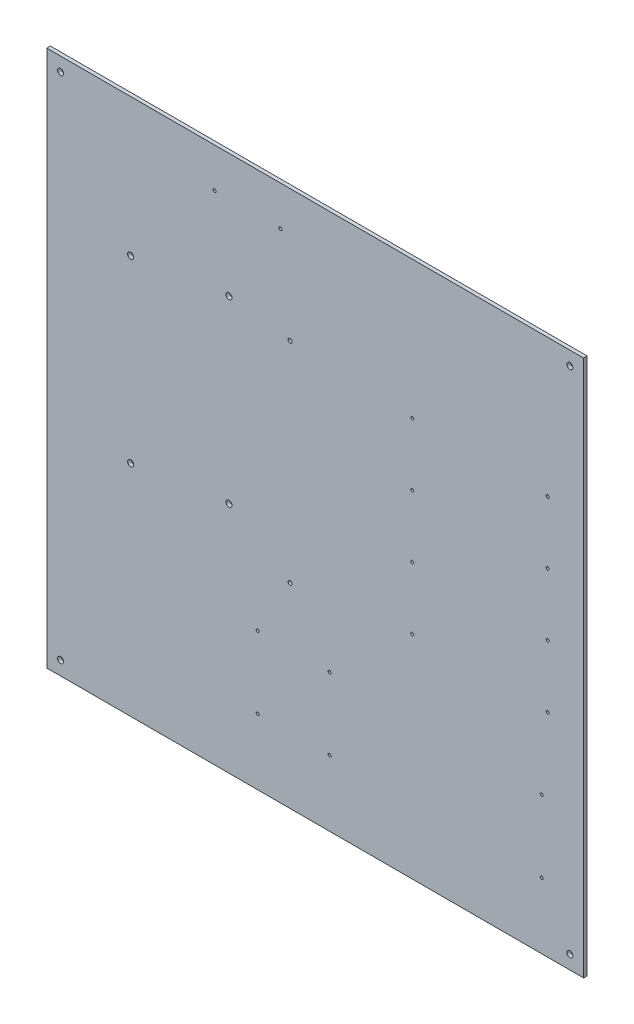
ISO-10303-21;
HEADER;
FILE_DESCRIPTION(('STEP AP214'),'2;1');
FILE_NAME('part.step','',(''),(''),'','','');
FILE_SCHEMA(('AUTOMOTIVE_DESIGN { 1 0 10303 214 1 1 1 1 }'));
ENDSEC;
DATA;
#1=APPLICATION_CONTEXT('core data for automotive mechanical design processes');
#2=APPLICATION_PROTOCOL_DEFINITION('international standard','automotive_design',2000,#1);
#3=PRODUCT_CONTEXT('',#1,'mechanical');
#4=PRODUCT('Part','Part','',(#3));
#5=PRODUCT_RELATED_PRODUCT_CATEGORY('part','',(#4));
#6=PRODUCT_DEFINITION_FORMATION('','',#4);
#7=PRODUCT_DEFINITION_CONTEXT('part definition',#1,'design');
#8=PRODUCT_DEFINITION('design','',#6,#7);
#9=PRODUCT_DEFINITION_SHAPE('','',#8);
#10=(LENGTH_UNIT() NAMED_UNIT(*) SI_UNIT(.MILLI.,.METRE.));
#11=(NAMED_UNIT(*) PLANE_ANGLE_UNIT() SI_UNIT($,.RADIAN.));
#12=(NAMED_UNIT(*) SI_UNIT($,.STERADIAN.) SOLID_ANGLE_UNIT());
#13=UNCERTAINTY_MEASURE_WITH_UNIT(LENGTH_MEASURE(1.E-05),#10,'distance_accuracy_value','');
#14=(GEOMETRIC_REPRESENTATION_CONTEXT(3) GLOBAL_UNCERTAINTY_ASSIGNED_CONTEXT((#13)) GLOBAL_UNIT_ASSIGNED_CONTEXT((#10,
#11,#12)) REPRESENTATION_CONTEXT('',''));
#15=CARTESIAN_POINT('',(0.,0.,0.));
#16=DIRECTION('',(0.,0.,1.));
#17=DIRECTION('',(1.,0.,0.));
#18=AXIS2_PLACEMENT_3D('',#15,#16,#17);
#19=CARTESIAN_POINT('',(0.,0.,-3.));
#20=DIRECTION('',(-1.,0.,0.));
#21=DIRECTION('',(0.,0.,1.));
#22=AXIS2_PLACEMENT_3D('',#19,#20,#21);
#23=PLANE('',#22);
#24=DIRECTION('',(0.,-1.,0.));
#25=VECTOR('',#24,1.);
#26=CARTESIAN_POINT('',(0.,0.,0.));
#27=LINE('',#26,#25);
#28=CARTESIAN_POINT('',(0.,448.,0.));
#29=VERTEX_POINT('',#28);
#30=CARTESIAN_POINT('',(0.,0.,0.));
#31=VERTEX_POINT('',#30);
#32=EDGE_CURVE('E108',#29,#31,#27,.T.);
#33=ORIENTED_EDGE('',*,*,#32,.F.);
#34=DIRECTION('',(0.,0.,1.));
#35=VECTOR('',#34,1.);
#36=CARTESIAN_POINT('',(0.,448.,-3.));
#37=LINE('',#36,#35);
#38=CARTESIAN_POINT('',(0.,448.,-3.));
#39=VERTEX_POINT('',#38);
#40=EDGE_CURVE('E12',#39,#29,#37,.T.);
#41=ORIENTED_EDGE('',*,*,#40,.F.);
#42=DIRECTION('',(0.,-1.,0.));
#43=VECTOR('',#42,1.);
#44=CARTESIAN_POINT('',(0.,0.,-3.));
#45=LINE('',#44,#43);
#46=CARTESIAN_POINT('',(0.,0.,-3.));
#47=VERTEX_POINT('',#46);
#48=EDGE_CURVE('E101',#39,#47,#45,.T.);
#49=ORIENTED_EDGE('',*,*,#48,.T.);
#50=DIRECTION('',(0.,0.,1.));
#51=VECTOR('',#50,1.);
#52=CARTESIAN_POINT('',(0.,0.,-3.));
#53=LINE('',#52,#51);
#54=EDGE_CURVE('E42',#47,#31,#53,.T.);
#55=ORIENTED_EDGE('',*,*,#54,.T.);
#56=EDGE_LOOP('',(#33,#41,#49,#55));
#57=FACE_BOUND('',#56,.T.);
#58=ADVANCED_FACE('F39',(#57),#23,.T.);
#59=CARTESIAN_POINT('',(0.,448.,-3.));
#60=DIRECTION('',(0.,1.,0.));
#61=DIRECTION('',(0.,0.,1.));
#62=AXIS2_PLACEMENT_3D('',#59,#60,#61);
#63=PLANE('',#62);
#64=DIRECTION('',(-1.,0.,0.));
#65=VECTOR('',#64,1.);
#66=CARTESIAN_POINT('',(0.,448.,0.));
#67=LINE('',#66,#65);
#68=CARTESIAN_POINT('',(448.,448.,0.));
#69=VERTEX_POINT('',#68);
#70=EDGE_CURVE('E103',#69,#29,#67,.T.);
#71=ORIENTED_EDGE('',*,*,#70,.F.);
#72=DIRECTION('',(0.,0.,1.));
#73=VECTOR('',#72,1.);
#74=CARTESIAN_POINT('',(448.,448.,-3.));
#75=LINE('',#74,#73);
#76=CARTESIAN_POINT('',(448.,448.,-3.));
#77=VERTEX_POINT('',#76);
#78=EDGE_CURVE('E48',#77,#69,#75,.T.);
#79=ORIENTED_EDGE('',*,*,#78,.F.);
#80=DIRECTION('',(-1.,0.,0.));
#81=VECTOR('',#80,1.);
#82=CARTESIAN_POINT('',(0.,448.,-3.));
#83=LINE('',#82,#81);
#84=EDGE_CURVE('E98',#77,#39,#83,.T.);
#85=ORIENTED_EDGE('',*,*,#84,.T.);
#86=ORIENTED_EDGE('',*,*,#40,.T.);
#87=EDGE_LOOP('',(#71,#79,#85,#86));
#88=FACE_BOUND('',#87,.T.);
#89=ADVANCED_FACE('F307',(#88),#63,.T.);
#90=CARTESIAN_POINT('',(448.,0.,-3.));
#91=DIRECTION('',(1.,0.,0.));
#92=DIRECTION('',(0.,0.,-1.));
#93=AXIS2_PLACEMENT_3D('',#90,#91,#92);
#94=PLANE('',#93);
#95=DIRECTION('',(0.,1.,0.));
#96=VECTOR('',#95,1.);
#97=CARTESIAN_POINT('',(448.,0.,0.));
#98=LINE('',#97,#96);
#99=CARTESIAN_POINT('',(448.,0.,0.));
#100=VERTEX_POINT('',#99);
#101=EDGE_CURVE('E93',#100,#69,#98,.T.);
#102=ORIENTED_EDGE('',*,*,#101,.F.);
#103=DIRECTION('',(0.,0.,1.));
#104=VECTOR('',#103,1.);
#105=CARTESIAN_POINT('',(448.,0.,-3.));
#106=LINE('',#105,#104);
#107=CARTESIAN_POINT('',(448.,0.,-3.));
#108=VERTEX_POINT('',#107);
#109=EDGE_CURVE('E88',#108,#100,#106,.T.);
#110=ORIENTED_EDGE('',*,*,#109,.F.);
#111=DIRECTION('',(0.,1.,0.));
#112=VECTOR('',#111,1.);
#113=CARTESIAN_POINT('',(448.,0.,-3.));
#114=LINE('',#113,#112);
#115=EDGE_CURVE('E91',#108,#77,#114,.T.);
#116=ORIENTED_EDGE('',*,*,#115,.T.);
#117=ORIENTED_EDGE('',*,*,#78,.T.);
#118=EDGE_LOOP('',(#102,#110,#116,#117));
#119=FACE_BOUND('',#118,.T.);
#120=ADVANCED_FACE('F90',(#119),#94,.T.);
#121=CARTESIAN_POINT('',(0.,0.,-3.));
#122=DIRECTION('',(0.,-1.,0.));
#123=DIRECTION('',(0.,0.,-1.));
#124=AXIS2_PLACEMENT_3D('',#121,#122,#123);
#125=PLANE('',#124);
#126=DIRECTION('',(1.,0.,0.));
#127=VECTOR('',#126,1.);
#128=CARTESIAN_POINT('',(0.,0.,0.));
#129=LINE('',#128,#127);
#130=EDGE_CURVE('E113',#31,#100,#129,.T.);
#131=ORIENTED_EDGE('',*,*,#130,.F.);
#132=ORIENTED_EDGE('',*,*,#54,.F.);
#133=DIRECTION('',(1.,0.,0.));
#134=VECTOR('',#133,1.);
#135=CARTESIAN_POINT('',(0.,0.,-3.));
#136=LINE('',#135,#134);
#137=EDGE_CURVE('E97',#47,#108,#136,.T.);
#138=ORIENTED_EDGE('',*,*,#137,.T.);
#139=ORIENTED_EDGE('',*,*,#109,.T.);
#140=EDGE_LOOP('',(#131,#132,#138,#139));
#141=FACE_BOUND('',#140,.T.);
#142=ADVANCED_FACE('F100',(#141),#125,.T.);
#143=CARTESIAN_POINT('',(0.,0.,-3.));
#144=DIRECTION('',(0.,0.,-1.));
#145=DIRECTION('',(-1.,0.,0.));
#146=AXIS2_PLACEMENT_3D('',#143,#144,#145);
#147=PLANE('',#146);
#148=CARTESIAN_POINT('',(413.,55.,-3.));
#149=DIRECTION('',(0.,0.,1.));
#150=DIRECTION('',(1.,0.,0.));
#151=AXIS2_PLACEMENT_3D('',#148,#149,#150);
#152=CIRCLE('',#151,1.24999999999996);
#153=CARTESIAN_POINT('',(414.25,55.,-3.));
#154=VERTEX_POINT('',#153);
#155=EDGE_CURVE('E145',#154,#154,#152,.T.);
#156=ORIENTED_EDGE('',*,*,#155,.T.);
#157=EDGE_LOOP('',(#156));
#158=FACE_BOUND('',#157,.T.);
#159=CARTESIAN_POINT('',(413.,115.,-3.));
#160=DIRECTION('',(0.,0.,1.));
#161=DIRECTION('',(1.,0.,0.));
#162=AXIS2_PLACEMENT_3D('',#159,#160,#161);
#163=CIRCLE('',#162,1.24999999999995);
#164=CARTESIAN_POINT('',(414.25,115.,-3.));
#165=VERTEX_POINT('',#164);
#166=EDGE_CURVE('E146',#165,#165,#163,.T.);
#167=ORIENTED_EDGE('',*,*,#166,.T.);
#168=EDGE_LOOP('',(#167));
#169=FACE_BOUND('',#168,.T.);
#170=CARTESIAN_POINT('',(236.,115.,-3.));
#171=DIRECTION('',(0.,0.,1.));
#172=DIRECTION('',(1.,0.,0.));
#173=AXIS2_PLACEMENT_3D('',#170,#171,#172);
#174=CIRCLE('',#173,1.25000000000001);
#175=CARTESIAN_POINT('',(237.25,115.,-3.));
#176=VERTEX_POINT('',#175);
#177=EDGE_CURVE('E154',#176,#176,#174,.T.);
#178=ORIENTED_EDGE('',*,*,#177,.T.);
#179=EDGE_LOOP('',(#178));
#180=FACE_BOUND('',#179,.T.);
#181=CARTESIAN_POINT('',(236.,55.,-3.));
#182=DIRECTION('',(0.,0.,1.));
#183=DIRECTION('',(1.,0.,0.));
#184=AXIS2_PLACEMENT_3D('',#181,#182,#183);
#185=CIRCLE('',#184,1.25000000000001);
#186=CARTESIAN_POINT('',(237.25,55.,-3.));
#187=VERTEX_POINT('',#186);
#188=EDGE_CURVE('E162',#187,#187,#185,.T.);
#189=ORIENTED_EDGE('',*,*,#188,.T.);
#190=EDGE_LOOP('',(#189));
#191=FACE_BOUND('',#190,.T.);
#192=CARTESIAN_POINT('',(176.,55.,-3.));
#193=DIRECTION('',(0.,0.,1.));
#194=DIRECTION('',(1.,0.,0.));
#195=AXIS2_PLACEMENT_3D('',#192,#193,#194);
#196=CIRCLE('',#195,1.24999999999995);
#197=CARTESIAN_POINT('',(177.25,55.,-3.));
#198=VERTEX_POINT('',#197);
#199=EDGE_CURVE('E169',#198,#198,#196,.T.);
#200=ORIENTED_EDGE('',*,*,#199,.T.);
#201=EDGE_LOOP('',(#200));
#202=FACE_BOUND('',#201,.T.);
#203=CARTESIAN_POINT('',(176.,115.,-3.));
#204=DIRECTION('',(0.,0.,1.));
#205=DIRECTION('',(1.,0.,0.));
#206=AXIS2_PLACEMENT_3D('',#203,#204,#205);
#207=CIRCLE('',#206,1.24999999999995);
#208=CARTESIAN_POINT('',(177.25,115.,-3.));
#209=VERTEX_POINT('',#208);
#210=EDGE_CURVE('E175',#209,#209,#207,.T.);
#211=ORIENTED_EDGE('',*,*,#210,.T.);
#212=EDGE_LOOP('',(#211));
#213=FACE_BOUND('',#212,.T.);
#214=CARTESIAN_POINT('',(203.,163.,-3.));
#215=DIRECTION('',(0.,0.,1.));
#216=DIRECTION('',(1.,0.,0.));
#217=AXIS2_PLACEMENT_3D('',#214,#215,#216);
#218=CIRCLE('',#217,1.65000000000002);
#219=CARTESIAN_POINT('',(204.65,163.,-3.));
#220=VERTEX_POINT('',#219);
#221=EDGE_CURVE('E181',#220,#220,#218,.T.);
#222=ORIENTED_EDGE('',*,*,#221,.T.);
#223=EDGE_LOOP('',(#222));
#224=FACE_BOUND('',#223,.T.);
#225=CARTESIAN_POINT('',(203.,338.,-3.));
#226=DIRECTION('',(0.,0.,1.));
#227=DIRECTION('',(1.,0.,0.));
#228=AXIS2_PLACEMENT_3D('',#225,#226,#227);
#229=CIRCLE('',#228,1.65000000000002);
#230=CARTESIAN_POINT('',(204.65,338.,-3.));
#231=VERTEX_POINT('',#230);
#232=EDGE_CURVE('E187',#231,#231,#229,.T.);
#233=ORIENTED_EDGE('',*,*,#232,.T.);
#234=EDGE_LOOP('',(#233));
#235=FACE_BOUND('',#234,.T.);
#236=CARTESIAN_POINT('',(152.,194.7695894105,-3.));
#237=DIRECTION('',(0.,0.,1.));
#238=DIRECTION('',(1.,0.,0.));
#239=AXIS2_PLACEMENT_3D('',#236,#237,#238);
#240=CIRCLE('',#239,2.5);
#241=CARTESIAN_POINT('',(154.5,194.7695894105,-3.));
#242=VERTEX_POINT('',#241);
#243=EDGE_CURVE('E193',#242,#242,#240,.T.);
#244=ORIENTED_EDGE('',*,*,#243,.T.);
#245=EDGE_LOOP('',(#244));
#246=FACE_BOUND('',#245,.T.);
#247=CARTESIAN_POINT('',(152.,344.7695894105,-3.));
#248=DIRECTION('',(0.,0.,1.));
#249=DIRECTION('',(1.,0.,0.));
#250=AXIS2_PLACEMENT_3D('',#247,#248,#249);
#251=CIRCLE('',#250,2.5);
#252=CARTESIAN_POINT('',(154.5,344.7695894105,-3.));
#253=VERTEX_POINT('',#252);
#254=EDGE_CURVE('E199',#253,#253,#251,.T.);
#255=ORIENTED_EDGE('',*,*,#254,.T.);
#256=EDGE_LOOP('',(#255));
#257=FACE_BOUND('',#256,.T.);
#258=CARTESIAN_POINT('',(70.,183.,-3.));
#259=DIRECTION('',(0.,0.,1.));
#260=DIRECTION('',(1.,0.,0.));
#261=AXIS2_PLACEMENT_3D('',#258,#259,#260);
#262=CIRCLE('',#261,2.5);
#263=CARTESIAN_POINT('',(72.5,183.,-3.));
#264=VERTEX_POINT('',#263);
#265=EDGE_CURVE('E205',#264,#264,#262,.T.);
#266=ORIENTED_EDGE('',*,*,#265,.T.);
#267=EDGE_LOOP('',(#266));
#268=FACE_BOUND('',#267,.T.);
#269=CARTESIAN_POINT('',(70.,333.,-3.));
#270=DIRECTION('',(0.,0.,1.));
#271=DIRECTION('',(1.,0.,0.));
#272=AXIS2_PLACEMENT_3D('',#269,#270,#271);
#273=CIRCLE('',#272,2.5);
#274=CARTESIAN_POINT('',(72.5,333.,-3.));
#275=VERTEX_POINT('',#274);
#276=EDGE_CURVE('E211',#275,#275,#273,.T.);
#277=ORIENTED_EDGE('',*,*,#276,.T.);
#278=EDGE_LOOP('',(#277));
#279=FACE_BOUND('',#278,.T.);
#280=CARTESIAN_POINT('',(195.,415.,-3.));
#281=DIRECTION('',(0.,0.,1.));
#282=DIRECTION('',(1.,0.,0.));
#283=AXIS2_PLACEMENT_3D('',#280,#281,#282);
#284=CIRCLE('',#283,1.25000000000001);
#285=CARTESIAN_POINT('',(196.25,415.,-3.));
#286=VERTEX_POINT('',#285);
#287=EDGE_CURVE('E217',#286,#286,#284,.T.);
#288=ORIENTED_EDGE('',*,*,#287,.T.);
#289=EDGE_LOOP('',(#288));
#290=FACE_BOUND('',#289,.T.);
#291=CARTESIAN_POINT('',(304.999999999999,333.,-3.));
#292=DIRECTION('',(0.,0.,1.));
#293=DIRECTION('',(1.,0.,0.));
#294=AXIS2_PLACEMENT_3D('',#291,#292,#293);
#295=CIRCLE('',#294,1.24999999999997);
#296=CARTESIAN_POINT('',(306.249999999999,333.,-3.));
#297=VERTEX_POINT('',#296);
#298=EDGE_CURVE('E223',#297,#297,#295,.T.);
#299=ORIENTED_EDGE('',*,*,#298,.T.);
#300=EDGE_LOOP('',(#299));
#301=FACE_BOUND('',#300,.T.);
#302=CARTESIAN_POINT('',(417.999999999999,333.,-3.));
#303=DIRECTION('',(0.,0.,1.));
#304=DIRECTION('',(1.,0.,0.));
#305=AXIS2_PLACEMENT_3D('',#302,#303,#304);
#306=CIRCLE('',#305,1.24999999999997);
#307=CARTESIAN_POINT('',(419.249999999999,333.,-3.));
#308=VERTEX_POINT('',#307);
#309=EDGE_CURVE('E229',#308,#308,#306,.T.);
#310=ORIENTED_EDGE('',*,*,#309,.T.);
#311=EDGE_LOOP('',(#310));
#312=FACE_BOUND('',#311,.T.);
#313=CARTESIAN_POINT('',(305.,281.,-3.));
#314=DIRECTION('',(0.,0.,1.));
#315=DIRECTION('',(1.,0.,0.));
#316=AXIS2_PLACEMENT_3D('',#313,#314,#315);
#317=CIRCLE('',#316,1.24999999999996);
#318=CARTESIAN_POINT('',(306.25,281.,-3.));
#319=VERTEX_POINT('',#318);
#320=EDGE_CURVE('E235',#319,#319,#317,.T.);
#321=ORIENTED_EDGE('',*,*,#320,.T.);
#322=EDGE_LOOP('',(#321));
#323=FACE_BOUND('',#322,.T.);
#324=CARTESIAN_POINT('',(418.,281.,-3.));
#325=DIRECTION('',(0.,0.,1.));
#326=DIRECTION('',(1.,0.,0.));
#327=AXIS2_PLACEMENT_3D('',#324,#325,#326);
#328=CIRCLE('',#327,1.24999999999996);
#329=CARTESIAN_POINT('',(419.25,281.,-3.));
#330=VERTEX_POINT('',#329);
#331=EDGE_CURVE('E241',#330,#330,#328,.T.);
#332=ORIENTED_EDGE('',*,*,#331,.T.);
#333=EDGE_LOOP('',(#332));
#334=FACE_BOUND('',#333,.T.);
#335=CARTESIAN_POINT('',(305.,229.,-3.));
#336=DIRECTION('',(0.,0.,1.));
#337=DIRECTION('',(1.,0.,0.));
#338=AXIS2_PLACEMENT_3D('',#335,#336,#337);
#339=CIRCLE('',#338,1.24999999999996);
#340=CARTESIAN_POINT('',(306.25,229.,-3.));
#341=VERTEX_POINT('',#340);
#342=EDGE_CURVE('E247',#341,#341,#339,.T.);
#343=ORIENTED_EDGE('',*,*,#342,.T.);
#344=EDGE_LOOP('',(#343));
#345=FACE_BOUND('',#344,.T.);
#346=CARTESIAN_POINT('',(418.,229.,-3.));
#347=DIRECTION('',(0.,0.,1.));
#348=DIRECTION('',(1.,0.,0.));
#349=AXIS2_PLACEMENT_3D('',#346,#347,#348);
#350=CIRCLE('',#349,1.24999999999996);
#351=CARTESIAN_POINT('',(419.25,229.,-3.));
#352=VERTEX_POINT('',#351);
#353=EDGE_CURVE('E253',#352,#352,#350,.T.);
#354=ORIENTED_EDGE('',*,*,#353,.T.);
#355=EDGE_LOOP('',(#354));
#356=FACE_BOUND('',#355,.T.);
#357=CARTESIAN_POINT('',(140.,415.,-3.));
#358=DIRECTION('',(0.,0.,1.));
#359=DIRECTION('',(1.,0.,0.));
#360=AXIS2_PLACEMENT_3D('',#357,#358,#359);
#361=CIRCLE('',#360,1.25000000000001);
#362=CARTESIAN_POINT('',(141.25,415.,-3.));
#363=VERTEX_POINT('',#362);
#364=EDGE_CURVE('E259',#363,#363,#361,.T.);
#365=ORIENTED_EDGE('',*,*,#364,.T.);
#366=EDGE_LOOP('',(#365));
#367=FACE_BOUND('',#366,.T.);
#368=CARTESIAN_POINT('',(305.,177.,-3.));
#369=DIRECTION('',(0.,0.,1.));
#370=DIRECTION('',(1.,0.,0.));
#371=AXIS2_PLACEMENT_3D('',#368,#369,#370);
#372=CIRCLE('',#371,1.24999999999996);
#373=CARTESIAN_POINT('',(306.25,177.,-3.));
#374=VERTEX_POINT('',#373);
#375=EDGE_CURVE('E265',#374,#374,#372,.T.);
#376=ORIENTED_EDGE('',*,*,#375,.T.);
#377=EDGE_LOOP('',(#376));
#378=FACE_BOUND('',#377,.T.);
#379=CARTESIAN_POINT('',(418.,177.,-3.));
#380=DIRECTION('',(0.,0.,1.));
#381=DIRECTION('',(1.,0.,0.));
#382=AXIS2_PLACEMENT_3D('',#379,#380,#381);
#383=CIRCLE('',#382,1.24999999999996);
#384=CARTESIAN_POINT('',(419.25,177.,-3.));
#385=VERTEX_POINT('',#384);
#386=EDGE_CURVE('E271',#385,#385,#383,.T.);
#387=ORIENTED_EDGE('',*,*,#386,.T.);
#388=EDGE_LOOP('',(#387));
#389=FACE_BOUND('',#388,.T.);
#390=CARTESIAN_POINT('',(436.5,11.5,-3.));
#391=DIRECTION('',(0.,0.,1.));
#392=DIRECTION('',(1.,0.,0.));
#393=AXIS2_PLACEMENT_3D('',#390,#391,#392);
#394=CIRCLE('',#393,2.50000000000002);
#395=CARTESIAN_POINT('',(439.,11.5,-3.));
#396=VERTEX_POINT('',#395);
#397=EDGE_CURVE('E277',#396,#396,#394,.T.);
#398=ORIENTED_EDGE('',*,*,#397,.T.);
#399=EDGE_LOOP('',(#398));
#400=FACE_BOUND('',#399,.T.);
#401=CARTESIAN_POINT('',(11.5,11.5,-3.));
#402=DIRECTION('',(0.,0.,1.));
#403=DIRECTION('',(-1.,0.,0.));
#404=AXIS2_PLACEMENT_3D('',#401,#402,#403);
#405=CIRCLE('',#404,2.5);
#406=CARTESIAN_POINT('',(9.,11.5,-3.));
#407=VERTEX_POINT('',#406);
#408=EDGE_CURVE('E283',#407,#407,#405,.T.);
#409=ORIENTED_EDGE('',*,*,#408,.T.);
#410=EDGE_LOOP('',(#409));
#411=FACE_BOUND('',#410,.T.);
#412=CARTESIAN_POINT('',(436.5,436.5,-3.));
#413=DIRECTION('',(0.,0.,1.));
#414=DIRECTION('',(-1.,0.,0.));
#415=AXIS2_PLACEMENT_3D('',#412,#413,#414);
#416=CIRCLE('',#415,2.50000000000002);
#417=CARTESIAN_POINT('',(434.,436.5,-3.));
#418=VERTEX_POINT('',#417);
#419=EDGE_CURVE('E289',#418,#418,#416,.T.);
#420=ORIENTED_EDGE('',*,*,#419,.T.);
#421=EDGE_LOOP('',(#420));
#422=FACE_BOUND('',#421,.T.);
#423=CARTESIAN_POINT('',(11.5,436.5,-3.));
#424=DIRECTION('',(0.,0.,1.));
#425=DIRECTION('',(1.,0.,0.));
#426=AXIS2_PLACEMENT_3D('',#423,#424,#425);
#427=CIRCLE('',#426,2.5);
#428=CARTESIAN_POINT('',(14.,436.5,-3.));
#429=VERTEX_POINT('',#428);
#430=EDGE_CURVE('E114',#429,#429,#427,.T.);
#431=ORIENTED_EDGE('',*,*,#430,.T.);
#432=EDGE_LOOP('',(#431));
#433=FACE_BOUND('',#432,.T.);
#434=ORIENTED_EDGE('',*,*,#48,.F.);
#435=ORIENTED_EDGE('',*,*,#84,.F.);
#436=ORIENTED_EDGE('',*,*,#115,.F.);
#437=ORIENTED_EDGE('',*,*,#137,.F.);
#438=EDGE_LOOP('',(#434,#435,#436,#437));
#439=FACE_BOUND('',#438,.T.);
#440=ADVANCED_FACE('F96',(#158,#169,#180,#191,#202,#213,#224,#235,#246,#257,#268,#279,#290,#301,
#312,#323,#334,#345,#356,#367,#378,#389,#400,#411,#422,#433,#439),#147,.T.);
#441=CARTESIAN_POINT('',(0.,0.,0.));
#442=DIRECTION('',(0.,0.,-1.));
#443=DIRECTION('',(-1.,0.,0.));
#444=AXIS2_PLACEMENT_3D('',#441,#442,#443);
#445=PLANE('',#444);
#446=CARTESIAN_POINT('',(413.,55.,0.));
#447=DIRECTION('',(0.,0.,1.));
#448=DIRECTION('',(1.,0.,0.));
#449=AXIS2_PLACEMENT_3D('',#446,#447,#448);
#450=CIRCLE('',#449,1.24999999999996);
#451=CARTESIAN_POINT('',(414.25,55.,0.));
#452=VERTEX_POINT('',#451);
#453=EDGE_CURVE('E139',#452,#452,#450,.T.);
#454=ORIENTED_EDGE('',*,*,#453,.F.);
#455=EDGE_LOOP('',(#454));
#456=FACE_BOUND('',#455,.T.);
#457=CARTESIAN_POINT('',(413.,115.,0.));
#458=DIRECTION('',(0.,0.,1.));
#459=DIRECTION('',(1.,0.,0.));
#460=AXIS2_PLACEMENT_3D('',#457,#458,#459);
#461=CIRCLE('',#460,1.24999999999995);
#462=CARTESIAN_POINT('',(414.25,115.,0.));
#463=VERTEX_POINT('',#462);
#464=EDGE_CURVE('E149',#463,#463,#461,.T.);
#465=ORIENTED_EDGE('',*,*,#464,.F.);
#466=EDGE_LOOP('',(#465));
#467=FACE_BOUND('',#466,.T.);
#468=CARTESIAN_POINT('',(236.,115.,0.));
#469=DIRECTION('',(0.,0.,1.));
#470=DIRECTION('',(1.,0.,0.));
#471=AXIS2_PLACEMENT_3D('',#468,#469,#470);
#472=CIRCLE('',#471,1.25000000000001);
#473=CARTESIAN_POINT('',(237.25,115.,0.));
#474=VERTEX_POINT('',#473);
#475=EDGE_CURVE('E148',#474,#474,#472,.T.);
#476=ORIENTED_EDGE('',*,*,#475,.F.);
#477=EDGE_LOOP('',(#476));
#478=FACE_BOUND('',#477,.T.);
#479=CARTESIAN_POINT('',(236.,55.,0.));
#480=DIRECTION('',(0.,0.,1.));
#481=DIRECTION('',(1.,0.,0.));
#482=AXIS2_PLACEMENT_3D('',#479,#480,#481);
#483=CIRCLE('',#482,1.25000000000001);
#484=CARTESIAN_POINT('',(237.25,55.,0.));
#485=VERTEX_POINT('',#484);
#486=EDGE_CURVE('E157',#485,#485,#483,.T.);
#487=ORIENTED_EDGE('',*,*,#486,.F.);
#488=EDGE_LOOP('',(#487));
#489=FACE_BOUND('',#488,.T.);
#490=CARTESIAN_POINT('',(176.,55.,0.));
#491=DIRECTION('',(0.,0.,1.));
#492=DIRECTION('',(1.,0.,0.));
#493=AXIS2_PLACEMENT_3D('',#490,#491,#492);
#494=CIRCLE('',#493,1.24999999999995);
#495=CARTESIAN_POINT('',(177.25,55.,0.));
#496=VERTEX_POINT('',#495);
#497=EDGE_CURVE('E164',#496,#496,#494,.T.);
#498=ORIENTED_EDGE('',*,*,#497,.F.);
#499=EDGE_LOOP('',(#498));
#500=FACE_BOUND('',#499,.T.);
#501=CARTESIAN_POINT('',(176.,115.,0.));
#502=DIRECTION('',(0.,0.,1.));
#503=DIRECTION('',(1.,0.,0.));
#504=AXIS2_PLACEMENT_3D('',#501,#502,#503);
#505=CIRCLE('',#504,1.24999999999995);
#506=CARTESIAN_POINT('',(177.25,115.,0.));
#507=VERTEX_POINT('',#506);
#508=EDGE_CURVE('E172',#507,#507,#505,.T.);
#509=ORIENTED_EDGE('',*,*,#508,.F.);
#510=EDGE_LOOP('',(#509));
#511=FACE_BOUND('',#510,.T.);
#512=CARTESIAN_POINT('',(203.,163.,0.));
#513=DIRECTION('',(0.,0.,1.));
#514=DIRECTION('',(1.,0.,0.));
#515=AXIS2_PLACEMENT_3D('',#512,#513,#514);
#516=CIRCLE('',#515,1.65000000000002);
#517=CARTESIAN_POINT('',(204.65,163.,0.));
#518=VERTEX_POINT('',#517);
#519=EDGE_CURVE('E178',#518,#518,#516,.T.);
#520=ORIENTED_EDGE('',*,*,#519,.F.);
#521=EDGE_LOOP('',(#520));
#522=FACE_BOUND('',#521,.T.);
#523=CARTESIAN_POINT('',(203.,338.,0.));
#524=DIRECTION('',(0.,0.,1.));
#525=DIRECTION('',(1.,0.,0.));
#526=AXIS2_PLACEMENT_3D('',#523,#524,#525);
#527=CIRCLE('',#526,1.65000000000002);
#528=CARTESIAN_POINT('',(204.65,338.,0.));
#529=VERTEX_POINT('',#528);
#530=EDGE_CURVE('E184',#529,#529,#527,.T.);
#531=ORIENTED_EDGE('',*,*,#530,.F.);
#532=EDGE_LOOP('',(#531));
#533=FACE_BOUND('',#532,.T.);
#534=CARTESIAN_POINT('',(152.,194.7695894105,0.));
#535=DIRECTION('',(0.,0.,1.));
#536=DIRECTION('',(1.,0.,0.));
#537=AXIS2_PLACEMENT_3D('',#534,#535,#536);
#538=CIRCLE('',#537,2.5);
#539=CARTESIAN_POINT('',(154.5,194.7695894105,0.));
#540=VERTEX_POINT('',#539);
#541=EDGE_CURVE('E190',#540,#540,#538,.T.);
#542=ORIENTED_EDGE('',*,*,#541,.F.);
#543=EDGE_LOOP('',(#542));
#544=FACE_BOUND('',#543,.T.);
#545=CARTESIAN_POINT('',(152.,344.7695894105,0.));
#546=DIRECTION('',(0.,0.,1.));
#547=DIRECTION('',(1.,0.,0.));
#548=AXIS2_PLACEMENT_3D('',#545,#546,#547);
#549=CIRCLE('',#548,2.5);
#550=CARTESIAN_POINT('',(154.5,344.7695894105,0.));
#551=VERTEX_POINT('',#550);
#552=EDGE_CURVE('E196',#551,#551,#549,.T.);
#553=ORIENTED_EDGE('',*,*,#552,.F.);
#554=EDGE_LOOP('',(#553));
#555=FACE_BOUND('',#554,.T.);
#556=CARTESIAN_POINT('',(70.,183.,0.));
#557=DIRECTION('',(0.,0.,1.));
#558=DIRECTION('',(1.,0.,0.));
#559=AXIS2_PLACEMENT_3D('',#556,#557,#558);
#560=CIRCLE('',#559,2.5);
#561=CARTESIAN_POINT('',(72.5,183.,0.));
#562=VERTEX_POINT('',#561);
#563=EDGE_CURVE('E202',#562,#562,#560,.T.);
#564=ORIENTED_EDGE('',*,*,#563,.F.);
#565=EDGE_LOOP('',(#564));
#566=FACE_BOUND('',#565,.T.);
#567=CARTESIAN_POINT('',(70.,333.,0.));
#568=DIRECTION('',(0.,0.,1.));
#569=DIRECTION('',(1.,0.,0.));
#570=AXIS2_PLACEMENT_3D('',#567,#568,#569);
#571=CIRCLE('',#570,2.5);
#572=CARTESIAN_POINT('',(72.5,333.,0.));
#573=VERTEX_POINT('',#572);
#574=EDGE_CURVE('E208',#573,#573,#571,.T.);
#575=ORIENTED_EDGE('',*,*,#574,.F.);
#576=EDGE_LOOP('',(#575));
#577=FACE_BOUND('',#576,.T.);
#578=CARTESIAN_POINT('',(195.,415.,0.));
#579=DIRECTION('',(0.,0.,1.));
#580=DIRECTION('',(1.,0.,0.));
#581=AXIS2_PLACEMENT_3D('',#578,#579,#580);
#582=CIRCLE('',#581,1.25000000000001);
#583=CARTESIAN_POINT('',(196.25,415.,0.));
#584=VERTEX_POINT('',#583);
#585=EDGE_CURVE('E214',#584,#584,#582,.T.);
#586=ORIENTED_EDGE('',*,*,#585,.F.);
#587=EDGE_LOOP('',(#586));
#588=FACE_BOUND('',#587,.T.);
#589=CARTESIAN_POINT('',(304.999999999999,333.,0.));
#590=DIRECTION('',(0.,0.,1.));
#591=DIRECTION('',(1.,0.,0.));
#592=AXIS2_PLACEMENT_3D('',#589,#590,#591);
#593=CIRCLE('',#592,1.24999999999997);
#594=CARTESIAN_POINT('',(306.249999999999,333.,0.));
#595=VERTEX_POINT('',#594);
#596=EDGE_CURVE('E220',#595,#595,#593,.T.);
#597=ORIENTED_EDGE('',*,*,#596,.F.);
#598=EDGE_LOOP('',(#597));
#599=FACE_BOUND('',#598,.T.);
#600=CARTESIAN_POINT('',(417.999999999999,333.,0.));
#601=DIRECTION('',(0.,0.,1.));
#602=DIRECTION('',(1.,0.,0.));
#603=AXIS2_PLACEMENT_3D('',#600,#601,#602);
#604=CIRCLE('',#603,1.24999999999997);
#605=CARTESIAN_POINT('',(419.249999999999,333.,0.));
#606=VERTEX_POINT('',#605);
#607=EDGE_CURVE('E226',#606,#606,#604,.T.);
#608=ORIENTED_EDGE('',*,*,#607,.F.);
#609=EDGE_LOOP('',(#608));
#610=FACE_BOUND('',#609,.T.);
#611=CARTESIAN_POINT('',(305.,281.,0.));
#612=DIRECTION('',(0.,0.,1.));
#613=DIRECTION('',(1.,0.,0.));
#614=AXIS2_PLACEMENT_3D('',#611,#612,#613);
#615=CIRCLE('',#614,1.24999999999996);
#616=CARTESIAN_POINT('',(306.25,281.,0.));
#617=VERTEX_POINT('',#616);
#618=EDGE_CURVE('E232',#617,#617,#615,.T.);
#619=ORIENTED_EDGE('',*,*,#618,.F.);
#620=EDGE_LOOP('',(#619));
#621=FACE_BOUND('',#620,.T.);
#622=CARTESIAN_POINT('',(418.,281.,0.));
#623=DIRECTION('',(0.,0.,1.));
#624=DIRECTION('',(1.,0.,0.));
#625=AXIS2_PLACEMENT_3D('',#622,#623,#624);
#626=CIRCLE('',#625,1.24999999999996);
#627=CARTESIAN_POINT('',(419.25,281.,0.));
#628=VERTEX_POINT('',#627);
#629=EDGE_CURVE('E238',#628,#628,#626,.T.);
#630=ORIENTED_EDGE('',*,*,#629,.F.);
#631=EDGE_LOOP('',(#630));
#632=FACE_BOUND('',#631,.T.);
#633=CARTESIAN_POINT('',(305.,229.,0.));
#634=DIRECTION('',(0.,0.,1.));
#635=DIRECTION('',(1.,0.,0.));
#636=AXIS2_PLACEMENT_3D('',#633,#634,#635);
#637=CIRCLE('',#636,1.24999999999996);
#638=CARTESIAN_POINT('',(306.25,229.,0.));
#639=VERTEX_POINT('',#638);
#640=EDGE_CURVE('E244',#639,#639,#637,.T.);
#641=ORIENTED_EDGE('',*,*,#640,.F.);
#642=EDGE_LOOP('',(#641));
#643=FACE_BOUND('',#642,.T.);
#644=CARTESIAN_POINT('',(418.,229.,0.));
#645=DIRECTION('',(0.,0.,1.));
#646=DIRECTION('',(1.,0.,0.));
#647=AXIS2_PLACEMENT_3D('',#644,#645,#646);
#648=CIRCLE('',#647,1.24999999999996);
#649=CARTESIAN_POINT('',(419.25,229.,0.));
#650=VERTEX_POINT('',#649);
#651=EDGE_CURVE('E250',#650,#650,#648,.T.);
#652=ORIENTED_EDGE('',*,*,#651,.F.);
#653=EDGE_LOOP('',(#652));
#654=FACE_BOUND('',#653,.T.);
#655=CARTESIAN_POINT('',(140.,415.,0.));
#656=DIRECTION('',(0.,0.,1.));
#657=DIRECTION('',(1.,0.,0.));
#658=AXIS2_PLACEMENT_3D('',#655,#656,#657);
#659=CIRCLE('',#658,1.25000000000001);
#660=CARTESIAN_POINT('',(141.25,415.,0.));
#661=VERTEX_POINT('',#660);
#662=EDGE_CURVE('E256',#661,#661,#659,.T.);
#663=ORIENTED_EDGE('',*,*,#662,.F.);
#664=EDGE_LOOP('',(#663));
#665=FACE_BOUND('',#664,.T.);
#666=CARTESIAN_POINT('',(305.,177.,0.));
#667=DIRECTION('',(0.,0.,1.));
#668=DIRECTION('',(1.,0.,0.));
#669=AXIS2_PLACEMENT_3D('',#666,#667,#668);
#670=CIRCLE('',#669,1.24999999999996);
#671=CARTESIAN_POINT('',(306.25,177.,0.));
#672=VERTEX_POINT('',#671);
#673=EDGE_CURVE('E262',#672,#672,#670,.T.);
#674=ORIENTED_EDGE('',*,*,#673,.F.);
#675=EDGE_LOOP('',(#674));
#676=FACE_BOUND('',#675,.T.);
#677=CARTESIAN_POINT('',(418.,177.,0.));
#678=DIRECTION('',(0.,0.,1.));
#679=DIRECTION('',(1.,0.,0.));
#680=AXIS2_PLACEMENT_3D('',#677,#678,#679);
#681=CIRCLE('',#680,1.24999999999996);
#682=CARTESIAN_POINT('',(419.25,177.,0.));
#683=VERTEX_POINT('',#682);
#684=EDGE_CURVE('E268',#683,#683,#681,.T.);
#685=ORIENTED_EDGE('',*,*,#684,.F.);
#686=EDGE_LOOP('',(#685));
#687=FACE_BOUND('',#686,.T.);
#688=CARTESIAN_POINT('',(436.5,11.5,0.));
#689=DIRECTION('',(0.,0.,1.));
#690=DIRECTION('',(1.,0.,0.));
#691=AXIS2_PLACEMENT_3D('',#688,#689,#690);
#692=CIRCLE('',#691,2.50000000000002);
#693=CARTESIAN_POINT('',(439.,11.5,0.));
#694=VERTEX_POINT('',#693);
#695=EDGE_CURVE('E274',#694,#694,#692,.T.);
#696=ORIENTED_EDGE('',*,*,#695,.F.);
#697=EDGE_LOOP('',(#696));
#698=FACE_BOUND('',#697,.T.);
#699=CARTESIAN_POINT('',(11.5,11.5,0.));
#700=DIRECTION('',(0.,0.,1.));
#701=DIRECTION('',(-1.,0.,0.));
#702=AXIS2_PLACEMENT_3D('',#699,#700,#701);
#703=CIRCLE('',#702,2.5);
#704=CARTESIAN_POINT('',(9.,11.5,0.));
#705=VERTEX_POINT('',#704);
#706=EDGE_CURVE('E280',#705,#705,#703,.T.);
#707=ORIENTED_EDGE('',*,*,#706,.F.);
#708=EDGE_LOOP('',(#707));
#709=FACE_BOUND('',#708,.T.);
#710=CARTESIAN_POINT('',(436.5,436.5,0.));
#711=DIRECTION('',(0.,0.,1.));
#712=DIRECTION('',(-1.,0.,0.));
#713=AXIS2_PLACEMENT_3D('',#710,#711,#712);
#714=CIRCLE('',#713,2.50000000000002);
#715=CARTESIAN_POINT('',(434.,436.5,0.));
#716=VERTEX_POINT('',#715);
#717=EDGE_CURVE('E286',#716,#716,#714,.T.);
#718=ORIENTED_EDGE('',*,*,#717,.F.);
#719=EDGE_LOOP('',(#718));
#720=FACE_BOUND('',#719,.T.);
#721=CARTESIAN_POINT('',(11.5,436.5,0.));
#722=DIRECTION('',(0.,0.,1.));
#723=DIRECTION('',(1.,0.,0.));
#724=AXIS2_PLACEMENT_3D('',#721,#722,#723);
#725=CIRCLE('',#724,2.5);
#726=CARTESIAN_POINT('',(14.,436.5,0.));
#727=VERTEX_POINT('',#726);
#728=EDGE_CURVE('E292',#727,#727,#725,.T.);
#729=ORIENTED_EDGE('',*,*,#728,.F.);
#730=EDGE_LOOP('',(#729));
#731=FACE_BOUND('',#730,.T.);
#732=ORIENTED_EDGE('',*,*,#32,.T.);
#733=ORIENTED_EDGE('',*,*,#130,.T.);
#734=ORIENTED_EDGE('',*,*,#101,.T.);
#735=ORIENTED_EDGE('',*,*,#70,.T.);
#736=EDGE_LOOP('',(#732,#733,#734,#735));
#737=FACE_BOUND('',#736,.T.);
#738=ADVANCED_FACE('F301',(#456,#467,#478,#489,#500,#511,#522,#533,#544,#555,#566,#577,#588,
#599,#610,#621,#632,#643,#654,#665,#676,#687,#698,#709,#720,#731,#737),#445,.F.);
#739=CARTESIAN_POINT('',(11.5,436.5,-3.));
#740=DIRECTION('',(0.,0.,1.));
#741=DIRECTION('',(1.,0.,0.));
#742=AXIS2_PLACEMENT_3D('',#739,#740,#741);
#743=CYLINDRICAL_SURFACE('',#742,2.5);
#744=ORIENTED_EDGE('',*,*,#430,.F.);
#745=EDGE_LOOP('',(#744));
#746=FACE_BOUND('',#745,.T.);
#747=ORIENTED_EDGE('',*,*,#728,.T.);
#748=EDGE_LOOP('',(#747));
#749=FACE_BOUND('',#748,.T.);
#750=ADVANCED_FACE('F299',(#746,#749),#743,.F.);
#751=CARTESIAN_POINT('',(436.5,436.5,-3.));
#752=DIRECTION('',(0.,0.,1.));
#753=DIRECTION('',(1.,0.,0.));
#754=AXIS2_PLACEMENT_3D('',#751,#752,#753);
#755=CYLINDRICAL_SURFACE('',#754,2.50000000000002);
#756=ORIENTED_EDGE('',*,*,#419,.F.);
#757=EDGE_LOOP('',(#756));
#758=FACE_BOUND('',#757,.T.);
#759=ORIENTED_EDGE('',*,*,#717,.T.);
#760=EDGE_LOOP('',(#759));
#761=FACE_BOUND('',#760,.T.);
#762=ADVANCED_FACE('F328',(#758,#761),#755,.F.);
#763=CARTESIAN_POINT('',(11.5,11.5,-3.));
#764=DIRECTION('',(0.,0.,1.));
#765=DIRECTION('',(1.,0.,0.));
#766=AXIS2_PLACEMENT_3D('',#763,#764,#765);
#767=CYLINDRICAL_SURFACE('',#766,2.5);
#768=ORIENTED_EDGE('',*,*,#408,.F.);
#769=EDGE_LOOP('',(#768));
#770=FACE_BOUND('',#769,.T.);
#771=ORIENTED_EDGE('',*,*,#706,.T.);
#772=EDGE_LOOP('',(#771));
#773=FACE_BOUND('',#772,.T.);
#774=ADVANCED_FACE('F332',(#770,#773),#767,.F.);
#775=CARTESIAN_POINT('',(436.5,11.5,-3.));
#776=DIRECTION('',(0.,0.,1.));
#777=DIRECTION('',(1.,0.,0.));
#778=AXIS2_PLACEMENT_3D('',#775,#776,#777);
#779=CYLINDRICAL_SURFACE('',#778,2.50000000000002);
#780=ORIENTED_EDGE('',*,*,#397,.F.);
#781=EDGE_LOOP('',(#780));
#782=FACE_BOUND('',#781,.T.);
#783=ORIENTED_EDGE('',*,*,#695,.T.);
#784=EDGE_LOOP('',(#783));
#785=FACE_BOUND('',#784,.T.);
#786=ADVANCED_FACE('F336',(#782,#785),#779,.F.);
#787=CARTESIAN_POINT('',(418.,177.,-3.));
#788=DIRECTION('',(0.,0.,1.));
#789=DIRECTION('',(1.,0.,0.));
#790=AXIS2_PLACEMENT_3D('',#787,#788,#789);
#791=CYLINDRICAL_SURFACE('',#790,1.24999999999996);
#792=ORIENTED_EDGE('',*,*,#386,.F.);
#793=EDGE_LOOP('',(#792));
#794=FACE_BOUND('',#793,.T.);
#795=ORIENTED_EDGE('',*,*,#684,.T.);
#796=EDGE_LOOP('',(#795));
#797=FACE_BOUND('',#796,.T.);
#798=ADVANCED_FACE('F340',(#794,#797),#791,.F.);
#799=CARTESIAN_POINT('',(305.,177.,-3.));
#800=DIRECTION('',(0.,0.,1.));
#801=DIRECTION('',(1.,0.,0.));
#802=AXIS2_PLACEMENT_3D('',#799,#800,#801);
#803=CYLINDRICAL_SURFACE('',#802,1.24999999999996);
#804=ORIENTED_EDGE('',*,*,#375,.F.);
#805=EDGE_LOOP('',(#804));
#806=FACE_BOUND('',#805,.T.);
#807=ORIENTED_EDGE('',*,*,#673,.T.);
#808=EDGE_LOOP('',(#807));
#809=FACE_BOUND('',#808,.T.);
#810=ADVANCED_FACE('F344',(#806,#809),#803,.F.);
#811=CARTESIAN_POINT('',(140.,415.,-3.));
#812=DIRECTION('',(0.,0.,1.));
#813=DIRECTION('',(1.,0.,0.));
#814=AXIS2_PLACEMENT_3D('',#811,#812,#813);
#815=CYLINDRICAL_SURFACE('',#814,1.25000000000001);
#816=ORIENTED_EDGE('',*,*,#364,.F.);
#817=EDGE_LOOP('',(#816));
#818=FACE_BOUND('',#817,.T.);
#819=ORIENTED_EDGE('',*,*,#662,.T.);
#820=EDGE_LOOP('',(#819));
#821=FACE_BOUND('',#820,.T.);
#822=ADVANCED_FACE('F348',(#818,#821),#815,.F.);
#823=CARTESIAN_POINT('',(418.,229.,-3.));
#824=DIRECTION('',(0.,0.,1.));
#825=DIRECTION('',(1.,0.,0.));
#826=AXIS2_PLACEMENT_3D('',#823,#824,#825);
#827=CYLINDRICAL_SURFACE('',#826,1.24999999999996);
#828=ORIENTED_EDGE('',*,*,#353,.F.);
#829=EDGE_LOOP('',(#828));
#830=FACE_BOUND('',#829,.T.);
#831=ORIENTED_EDGE('',*,*,#651,.T.);
#832=EDGE_LOOP('',(#831));
#833=FACE_BOUND('',#832,.T.);
#834=ADVANCED_FACE('F352',(#830,#833),#827,.F.);
#835=CARTESIAN_POINT('',(305.,229.,-3.));
#836=DIRECTION('',(0.,0.,1.));
#837=DIRECTION('',(1.,0.,0.));
#838=AXIS2_PLACEMENT_3D('',#835,#836,#837);
#839=CYLINDRICAL_SURFACE('',#838,1.24999999999996);
#840=ORIENTED_EDGE('',*,*,#342,.F.);
#841=EDGE_LOOP('',(#840));
#842=FACE_BOUND('',#841,.T.);
#843=ORIENTED_EDGE('',*,*,#640,.T.);
#844=EDGE_LOOP('',(#843));
#845=FACE_BOUND('',#844,.T.);
#846=ADVANCED_FACE('F356',(#842,#845),#839,.F.);
#847=CARTESIAN_POINT('',(418.,281.,-3.));
#848=DIRECTION('',(0.,0.,1.));
#849=DIRECTION('',(1.,0.,0.));
#850=AXIS2_PLACEMENT_3D('',#847,#848,#849);
#851=CYLINDRICAL_SURFACE('',#850,1.24999999999996);
#852=ORIENTED_EDGE('',*,*,#331,.F.);
#853=EDGE_LOOP('',(#852));
#854=FACE_BOUND('',#853,.T.);
#855=ORIENTED_EDGE('',*,*,#629,.T.);
#856=EDGE_LOOP('',(#855));
#857=FACE_BOUND('',#856,.T.);
#858=ADVANCED_FACE('F360',(#854,#857),#851,.F.);
#859=CARTESIAN_POINT('',(305.,281.,-3.));
#860=DIRECTION('',(0.,0.,1.));
#861=DIRECTION('',(1.,0.,0.));
#862=AXIS2_PLACEMENT_3D('',#859,#860,#861);
#863=CYLINDRICAL_SURFACE('',#862,1.24999999999996);
#864=ORIENTED_EDGE('',*,*,#320,.F.);
#865=EDGE_LOOP('',(#864));
#866=FACE_BOUND('',#865,.T.);
#867=ORIENTED_EDGE('',*,*,#618,.T.);
#868=EDGE_LOOP('',(#867));
#869=FACE_BOUND('',#868,.T.);
#870=ADVANCED_FACE('F364',(#866,#869),#863,.F.);
#871=CARTESIAN_POINT('',(417.999999999999,333.,-3.));
#872=DIRECTION('',(0.,0.,1.));
#873=DIRECTION('',(1.,0.,0.));
#874=AXIS2_PLACEMENT_3D('',#871,#872,#873);
#875=CYLINDRICAL_SURFACE('',#874,1.24999999999997);
#876=ORIENTED_EDGE('',*,*,#309,.F.);
#877=EDGE_LOOP('',(#876));
#878=FACE_BOUND('',#877,.T.);
#879=ORIENTED_EDGE('',*,*,#607,.T.);
#880=EDGE_LOOP('',(#879));
#881=FACE_BOUND('',#880,.T.);
#882=ADVANCED_FACE('F368',(#878,#881),#875,.F.);
#883=CARTESIAN_POINT('',(304.999999999999,333.,-3.));
#884=DIRECTION('',(0.,0.,1.));
#885=DIRECTION('',(1.,0.,0.));
#886=AXIS2_PLACEMENT_3D('',#883,#884,#885);
#887=CYLINDRICAL_SURFACE('',#886,1.24999999999997);
#888=ORIENTED_EDGE('',*,*,#298,.F.);
#889=EDGE_LOOP('',(#888));
#890=FACE_BOUND('',#889,.T.);
#891=ORIENTED_EDGE('',*,*,#596,.T.);
#892=EDGE_LOOP('',(#891));
#893=FACE_BOUND('',#892,.T.);
#894=ADVANCED_FACE('F372',(#890,#893),#887,.F.);
#895=CARTESIAN_POINT('',(195.,415.,-3.));
#896=DIRECTION('',(0.,0.,1.));
#897=DIRECTION('',(1.,0.,0.));
#898=AXIS2_PLACEMENT_3D('',#895,#896,#897);
#899=CYLINDRICAL_SURFACE('',#898,1.25000000000001);
#900=ORIENTED_EDGE('',*,*,#287,.F.);
#901=EDGE_LOOP('',(#900));
#902=FACE_BOUND('',#901,.T.);
#903=ORIENTED_EDGE('',*,*,#585,.T.);
#904=EDGE_LOOP('',(#903));
#905=FACE_BOUND('',#904,.T.);
#906=ADVANCED_FACE('F376',(#902,#905),#899,.F.);
#907=CARTESIAN_POINT('',(70.,333.,-3.));
#908=DIRECTION('',(0.,0.,1.));
#909=DIRECTION('',(1.,0.,0.));
#910=AXIS2_PLACEMENT_3D('',#907,#908,#909);
#911=CYLINDRICAL_SURFACE('',#910,2.5);
#912=ORIENTED_EDGE('',*,*,#276,.F.);
#913=EDGE_LOOP('',(#912));
#914=FACE_BOUND('',#913,.T.);
#915=ORIENTED_EDGE('',*,*,#574,.T.);
#916=EDGE_LOOP('',(#915));
#917=FACE_BOUND('',#916,.T.);
#918=ADVANCED_FACE('F380',(#914,#917),#911,.F.);
#919=CARTESIAN_POINT('',(70.,183.,-3.));
#920=DIRECTION('',(0.,0.,1.));
#921=DIRECTION('',(1.,0.,0.));
#922=AXIS2_PLACEMENT_3D('',#919,#920,#921);
#923=CYLINDRICAL_SURFACE('',#922,2.5);
#924=ORIENTED_EDGE('',*,*,#265,.F.);
#925=EDGE_LOOP('',(#924));
#926=FACE_BOUND('',#925,.T.);
#927=ORIENTED_EDGE('',*,*,#563,.T.);
#928=EDGE_LOOP('',(#927));
#929=FACE_BOUND('',#928,.T.);
#930=ADVANCED_FACE('F384',(#926,#929),#923,.F.);
#931=CARTESIAN_POINT('',(152.,344.7695894105,-3.));
#932=DIRECTION('',(0.,0.,1.));
#933=DIRECTION('',(1.,0.,0.));
#934=AXIS2_PLACEMENT_3D('',#931,#932,#933);
#935=CYLINDRICAL_SURFACE('',#934,2.5);
#936=ORIENTED_EDGE('',*,*,#254,.F.);
#937=EDGE_LOOP('',(#936));
#938=FACE_BOUND('',#937,.T.);
#939=ORIENTED_EDGE('',*,*,#552,.T.);
#940=EDGE_LOOP('',(#939));
#941=FACE_BOUND('',#940,.T.);
#942=ADVANCED_FACE('F388',(#938,#941),#935,.F.);
#943=CARTESIAN_POINT('',(152.,194.7695894105,-3.));
#944=DIRECTION('',(0.,0.,1.));
#945=DIRECTION('',(1.,0.,0.));
#946=AXIS2_PLACEMENT_3D('',#943,#944,#945);
#947=CYLINDRICAL_SURFACE('',#946,2.5);
#948=ORIENTED_EDGE('',*,*,#243,.F.);
#949=EDGE_LOOP('',(#948));
#950=FACE_BOUND('',#949,.T.);
#951=ORIENTED_EDGE('',*,*,#541,.T.);
#952=EDGE_LOOP('',(#951));
#953=FACE_BOUND('',#952,.T.);
#954=ADVANCED_FACE('F392',(#950,#953),#947,.F.);
#955=CARTESIAN_POINT('',(203.,338.,-3.));
#956=DIRECTION('',(0.,0.,1.));
#957=DIRECTION('',(1.,0.,0.));
#958=AXIS2_PLACEMENT_3D('',#955,#956,#957);
#959=CYLINDRICAL_SURFACE('',#958,1.65000000000002);
#960=ORIENTED_EDGE('',*,*,#232,.F.);
#961=EDGE_LOOP('',(#960));
#962=FACE_BOUND('',#961,.T.);
#963=ORIENTED_EDGE('',*,*,#530,.T.);
#964=EDGE_LOOP('',(#963));
#965=FACE_BOUND('',#964,.T.);
#966=ADVANCED_FACE('F396',(#962,#965),#959,.F.);
#967=CARTESIAN_POINT('',(203.,163.,-3.));
#968=DIRECTION('',(0.,0.,1.));
#969=DIRECTION('',(1.,0.,0.));
#970=AXIS2_PLACEMENT_3D('',#967,#968,#969);
#971=CYLINDRICAL_SURFACE('',#970,1.65000000000002);
#972=ORIENTED_EDGE('',*,*,#221,.F.);
#973=EDGE_LOOP('',(#972));
#974=FACE_BOUND('',#973,.T.);
#975=ORIENTED_EDGE('',*,*,#519,.T.);
#976=EDGE_LOOP('',(#975));
#977=FACE_BOUND('',#976,.T.);
#978=ADVANCED_FACE('F400',(#974,#977),#971,.F.);
#979=CARTESIAN_POINT('',(176.,115.,-3.));
#980=DIRECTION('',(0.,0.,1.));
#981=DIRECTION('',(1.,0.,0.));
#982=AXIS2_PLACEMENT_3D('',#979,#980,#981);
#983=CYLINDRICAL_SURFACE('',#982,1.24999999999995);
#984=ORIENTED_EDGE('',*,*,#210,.F.);
#985=EDGE_LOOP('',(#984));
#986=FACE_BOUND('',#985,.T.);
#987=ORIENTED_EDGE('',*,*,#508,.T.);
#988=EDGE_LOOP('',(#987));
#989=FACE_BOUND('',#988,.T.);
#990=ADVANCED_FACE('F404',(#986,#989),#983,.F.);
#991=CARTESIAN_POINT('',(176.,55.,-3.));
#992=DIRECTION('',(0.,0.,1.));
#993=DIRECTION('',(1.,0.,0.));
#994=AXIS2_PLACEMENT_3D('',#991,#992,#993);
#995=CYLINDRICAL_SURFACE('',#994,1.24999999999995);
#996=ORIENTED_EDGE('',*,*,#199,.F.);
#997=EDGE_LOOP('',(#996));
#998=FACE_BOUND('',#997,.T.);
#999=ORIENTED_EDGE('',*,*,#497,.T.);
#1000=EDGE_LOOP('',(#999));
#1001=FACE_BOUND('',#1000,.T.);
#1002=ADVANCED_FACE('F408',(#998,#1001),#995,.F.);
#1003=CARTESIAN_POINT('',(236.,55.,-3.));
#1004=DIRECTION('',(0.,0.,1.));
#1005=DIRECTION('',(1.,0.,0.));
#1006=AXIS2_PLACEMENT_3D('',#1003,#1004,#1005);
#1007=CYLINDRICAL_SURFACE('',#1006,1.25000000000001);
#1008=ORIENTED_EDGE('',*,*,#188,.F.);
#1009=EDGE_LOOP('',(#1008));
#1010=FACE_BOUND('',#1009,.T.);
#1011=ORIENTED_EDGE('',*,*,#486,.T.);
#1012=EDGE_LOOP('',(#1011));
#1013=FACE_BOUND('',#1012,.T.);
#1014=ADVANCED_FACE('F412',(#1010,#1013),#1007,.F.);
#1015=CARTESIAN_POINT('',(236.,115.,-3.));
#1016=DIRECTION('',(0.,0.,1.));
#1017=DIRECTION('',(1.,0.,0.));
#1018=AXIS2_PLACEMENT_3D('',#1015,#1016,#1017);
#1019=CYLINDRICAL_SURFACE('',#1018,1.25000000000001);
#1020=ORIENTED_EDGE('',*,*,#177,.F.);
#1021=EDGE_LOOP('',(#1020));
#1022=FACE_BOUND('',#1021,.T.);
#1023=ORIENTED_EDGE('',*,*,#475,.T.);
#1024=EDGE_LOOP('',(#1023));
#1025=FACE_BOUND('',#1024,.T.);
#1026=ADVANCED_FACE('F416',(#1022,#1025),#1019,.F.);
#1027=CARTESIAN_POINT('',(413.,115.,-3.));
#1028=DIRECTION('',(0.,0.,1.));
#1029=DIRECTION('',(1.,0.,0.));
#1030=AXIS2_PLACEMENT_3D('',#1027,#1028,#1029);
#1031=CYLINDRICAL_SURFACE('',#1030,1.24999999999995);
#1032=ORIENTED_EDGE('',*,*,#166,.F.);
#1033=EDGE_LOOP('',(#1032));
#1034=FACE_BOUND('',#1033,.T.);
#1035=ORIENTED_EDGE('',*,*,#464,.T.);
#1036=EDGE_LOOP('',(#1035));
#1037=FACE_BOUND('',#1036,.T.);
#1038=ADVANCED_FACE('F420',(#1034,#1037),#1031,.F.);
#1039=CARTESIAN_POINT('',(413.,55.,-3.));
#1040=DIRECTION('',(0.,0.,1.));
#1041=DIRECTION('',(1.,0.,0.));
#1042=AXIS2_PLACEMENT_3D('',#1039,#1040,#1041);
#1043=CYLINDRICAL_SURFACE('',#1042,1.24999999999996);
#1044=ORIENTED_EDGE('',*,*,#155,.F.);
#1045=EDGE_LOOP('',(#1044));
#1046=FACE_BOUND('',#1045,.T.);
#1047=ORIENTED_EDGE('',*,*,#453,.T.);
#1048=EDGE_LOOP('',(#1047));
#1049=FACE_BOUND('',#1048,.T.);
#1050=ADVANCED_FACE('F424',(#1046,#1049),#1043,.F.);
#1051=CLOSED_SHELL('',(#58,#89,#120,#142,#440,#738,#750,#762,#774,#786,#798,#810,#822,#834,#846,
#858,#870,#882,#894,#906,#918,#930,#942,#954,#966,#978,#990,#1002,#1014,#1026,#1038,#1050));
#1052=MANIFOLD_SOLID_BREP('B2',#1051);
#1053=ADVANCED_BREP_SHAPE_REPRESENTATION('',(#18,#1052),#14);
#1054=SHAPE_DEFINITION_REPRESENTATION(#9,#1053);
ENDSEC;
END-ISO-10303-21;
